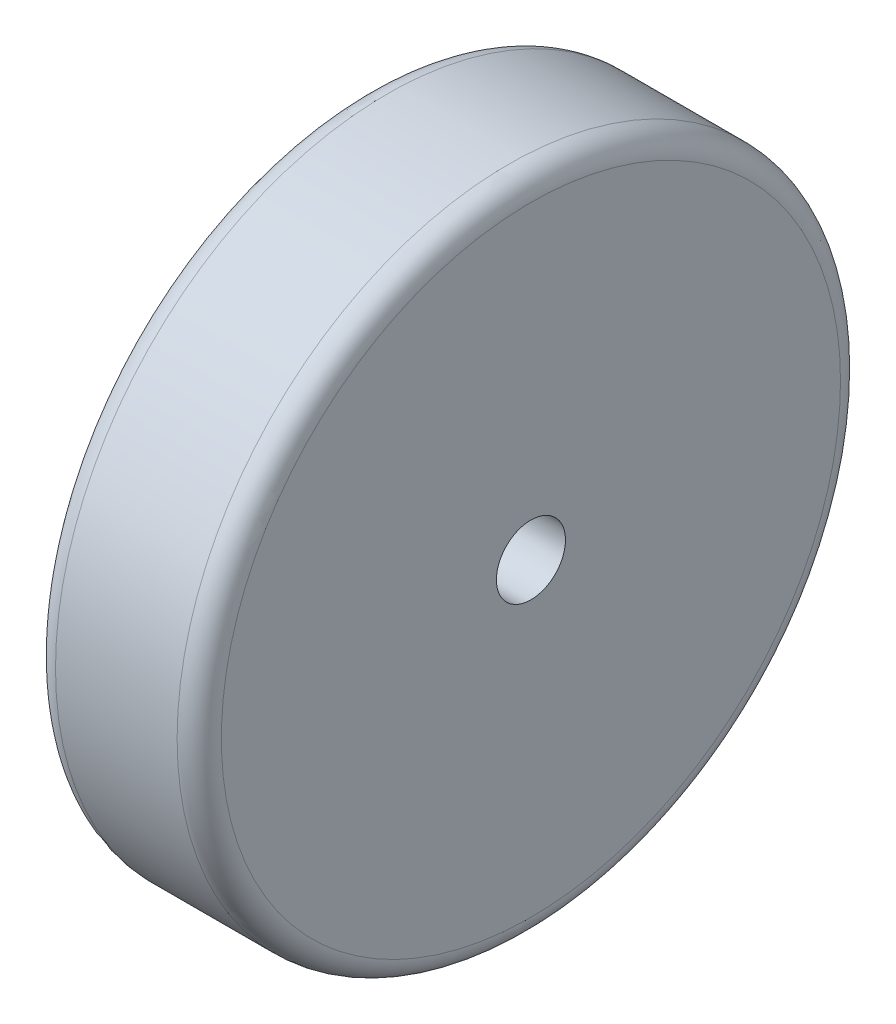
ISO-10303-21;
HEADER;
FILE_DESCRIPTION(('STEP AP214'),'2;1');
FILE_NAME('part.step','',(''),(''),'','','');
FILE_SCHEMA(('AUTOMOTIVE_DESIGN { 1 0 10303 214 1 1 1 1 }'));
ENDSEC;
DATA;
#1=APPLICATION_CONTEXT('core data for automotive mechanical design processes');
#2=APPLICATION_PROTOCOL_DEFINITION('international standard','automotive_design',2000,#1);
#3=PRODUCT_CONTEXT('',#1,'mechanical');
#4=PRODUCT('Part','Part','',(#3));
#5=PRODUCT_RELATED_PRODUCT_CATEGORY('part','',(#4));
#6=PRODUCT_DEFINITION_FORMATION('','',#4);
#7=PRODUCT_DEFINITION_CONTEXT('part definition',#1,'design');
#8=PRODUCT_DEFINITION('design','',#6,#7);
#9=PRODUCT_DEFINITION_SHAPE('','',#8);
#10=(LENGTH_UNIT() NAMED_UNIT(*) SI_UNIT(.MILLI.,.METRE.));
#11=(NAMED_UNIT(*) PLANE_ANGLE_UNIT() SI_UNIT($,.RADIAN.));
#12=(NAMED_UNIT(*) SI_UNIT($,.STERADIAN.) SOLID_ANGLE_UNIT());
#13=UNCERTAINTY_MEASURE_WITH_UNIT(LENGTH_MEASURE(1.E-05),#10,'distance_accuracy_value','');
#14=(GEOMETRIC_REPRESENTATION_CONTEXT(3) GLOBAL_UNCERTAINTY_ASSIGNED_CONTEXT((#13)) GLOBAL_UNIT_ASSIGNED_CONTEXT((#10,
#11,#12)) REPRESENTATION_CONTEXT('',''));
#15=CARTESIAN_POINT('',(0.,0.,0.));
#16=DIRECTION('',(0.,0.,1.));
#17=DIRECTION('',(1.,0.,0.));
#18=AXIS2_PLACEMENT_3D('',#15,#16,#17);
#19=CARTESIAN_POINT('',(38.1,0.,0.));
#20=DIRECTION('',(1.,0.,0.));
#21=DIRECTION('',(0.,0.,-1.));
#22=AXIS2_PLACEMENT_3D('',#19,#20,#21);
#23=PLANE('',#22);
#24=CARTESIAN_POINT('',(38.1,0.,0.));
#25=DIRECTION('',(1.,0.,0.));
#26=DIRECTION('',(0.,0.,-1.));
#27=AXIS2_PLACEMENT_3D('',#24,#25,#26);
#28=CIRCLE('',#27,71.12);
#29=CARTESIAN_POINT('',(38.1,0.,-71.12));
#30=VERTEX_POINT('',#29);
#31=EDGE_CURVE('E45',#30,#30,#28,.T.);
#32=ORIENTED_EDGE('',*,*,#31,.T.);
#33=EDGE_LOOP('',(#32));
#34=FACE_BOUND('',#33,.T.);
#35=CARTESIAN_POINT('',(38.1,0.,0.));
#36=DIRECTION('',(1.,0.,0.));
#37=DIRECTION('',(0.,0.,-1.));
#38=AXIS2_PLACEMENT_3D('',#35,#36,#37);
#39=CIRCLE('',#38,7.9375);
#40=CARTESIAN_POINT('',(38.1,0.,-7.9375));
#41=VERTEX_POINT('',#40);
#42=EDGE_CURVE('E50',#41,#41,#39,.T.);
#43=ORIENTED_EDGE('',*,*,#42,.F.);
#44=EDGE_LOOP('',(#43));
#45=FACE_BOUND('',#44,.T.);
#46=ADVANCED_FACE('F30',(#34,#45),#23,.T.);
#47=CARTESIAN_POINT('',(0.,0.,0.));
#48=DIRECTION('',(1.,0.,0.));
#49=DIRECTION('',(0.,0.,-1.));
#50=AXIS2_PLACEMENT_3D('',#47,#48,#49);
#51=PLANE('',#50);
#52=CARTESIAN_POINT('',(0.,0.,0.));
#53=DIRECTION('',(1.,0.,0.));
#54=DIRECTION('',(0.,0.,-1.));
#55=AXIS2_PLACEMENT_3D('',#52,#53,#54);
#56=CIRCLE('',#55,71.12);
#57=CARTESIAN_POINT('',(0.,0.,-71.12));
#58=VERTEX_POINT('',#57);
#59=EDGE_CURVE('E10',#58,#58,#56,.F.);
#60=ORIENTED_EDGE('',*,*,#59,.T.);
#61=EDGE_LOOP('',(#60));
#62=FACE_BOUND('',#61,.T.);
#63=CARTESIAN_POINT('',(0.,0.,0.));
#64=DIRECTION('',(1.,0.,0.));
#65=DIRECTION('',(0.,0.,-1.));
#66=AXIS2_PLACEMENT_3D('',#63,#64,#65);
#67=CIRCLE('',#66,7.9375);
#68=CARTESIAN_POINT('',(0.,0.,-7.9375));
#69=VERTEX_POINT('',#68);
#70=EDGE_CURVE('E51',#69,#69,#67,.T.);
#71=ORIENTED_EDGE('',*,*,#70,.T.);
#72=EDGE_LOOP('',(#71));
#73=FACE_BOUND('',#72,.T.);
#74=ADVANCED_FACE('F61',(#62,#73),#51,.F.);
#75=CARTESIAN_POINT('',(38.1,0.,0.));
#76=DIRECTION('',(-1.,0.,0.));
#77=DIRECTION('',(0.,0.,1.));
#78=AXIS2_PLACEMENT_3D('',#75,#76,#77);
#79=CYLINDRICAL_SURFACE('',#78,76.2);
#80=CARTESIAN_POINT('',(33.02,0.,0.));
#81=DIRECTION('',(1.,0.,0.));
#82=DIRECTION('',(0.,0.,-1.));
#83=AXIS2_PLACEMENT_3D('',#80,#81,#82);
#84=CIRCLE('',#83,76.2);
#85=CARTESIAN_POINT('',(33.02,0.,-76.2));
#86=VERTEX_POINT('',#85);
#87=EDGE_CURVE('E37',#86,#86,#84,.F.);
#88=ORIENTED_EDGE('',*,*,#87,.T.);
#89=EDGE_LOOP('',(#88));
#90=FACE_BOUND('',#89,.T.);
#91=CARTESIAN_POINT('',(5.08,0.,0.));
#92=DIRECTION('',(1.,0.,0.));
#93=DIRECTION('',(0.,0.,-1.));
#94=AXIS2_PLACEMENT_3D('',#91,#92,#93);
#95=CIRCLE('',#94,76.2);
#96=CARTESIAN_POINT('',(5.08,0.,-76.2));
#97=VERTEX_POINT('',#96);
#98=EDGE_CURVE('E41',#97,#97,#95,.T.);
#99=ORIENTED_EDGE('',*,*,#98,.T.);
#100=EDGE_LOOP('',(#99));
#101=FACE_BOUND('',#100,.T.);
#102=ADVANCED_FACE('F67',(#90,#101),#79,.T.);
#103=CARTESIAN_POINT('',(38.1,0.,0.));
#104=DIRECTION('',(-1.,0.,0.));
#105=DIRECTION('',(0.,0.,1.));
#106=AXIS2_PLACEMENT_3D('',#103,#104,#105);
#107=CYLINDRICAL_SURFACE('',#106,7.9375);
#108=ORIENTED_EDGE('',*,*,#42,.T.);
#109=EDGE_LOOP('',(#108));
#110=FACE_BOUND('',#109,.T.);
#111=ORIENTED_EDGE('',*,*,#70,.F.);
#112=EDGE_LOOP('',(#111));
#113=FACE_BOUND('',#112,.T.);
#114=ADVANCED_FACE('F57',(#110,#113),#107,.F.);
#115=CARTESIAN_POINT('',(33.02,0.,0.));
#116=DIRECTION('',(1.,0.,0.));
#117=DIRECTION('',(0.,0.,-1.));
#118=AXIS2_PLACEMENT_3D('',#115,#116,#117);
#119=TOROIDAL_SURFACE('',#118,71.12,5.08);
#120=ORIENTED_EDGE('',*,*,#87,.F.);
#121=EDGE_LOOP('',(#120));
#122=FACE_BOUND('',#121,.T.);
#123=ORIENTED_EDGE('',*,*,#31,.F.);
#124=EDGE_LOOP('',(#123));
#125=FACE_BOUND('',#124,.T.);
#126=ADVANCED_FACE('F72',(#122,#125),#119,.T.);
#127=CARTESIAN_POINT('',(5.08,0.,0.));
#128=DIRECTION('',(1.,0.,0.));
#129=DIRECTION('',(0.,0.,-1.));
#130=AXIS2_PLACEMENT_3D('',#127,#128,#129);
#131=TOROIDAL_SURFACE('',#130,71.12,5.08);
#132=ORIENTED_EDGE('',*,*,#59,.F.);
#133=EDGE_LOOP('',(#132));
#134=FACE_BOUND('',#133,.T.);
#135=ORIENTED_EDGE('',*,*,#98,.F.);
#136=EDGE_LOOP('',(#135));
#137=FACE_BOUND('',#136,.T.);
#138=ADVANCED_FACE('F32',(#134,#137),#131,.T.);
#139=CLOSED_SHELL('',(#46,#74,#102,#114,#126,#138));
#140=MANIFOLD_SOLID_BREP('B2',#139);
#141=ADVANCED_BREP_SHAPE_REPRESENTATION('',(#18,#140),#14);
#142=SHAPE_DEFINITION_REPRESENTATION(#9,#141);
ENDSEC;
END-ISO-10303-21;
